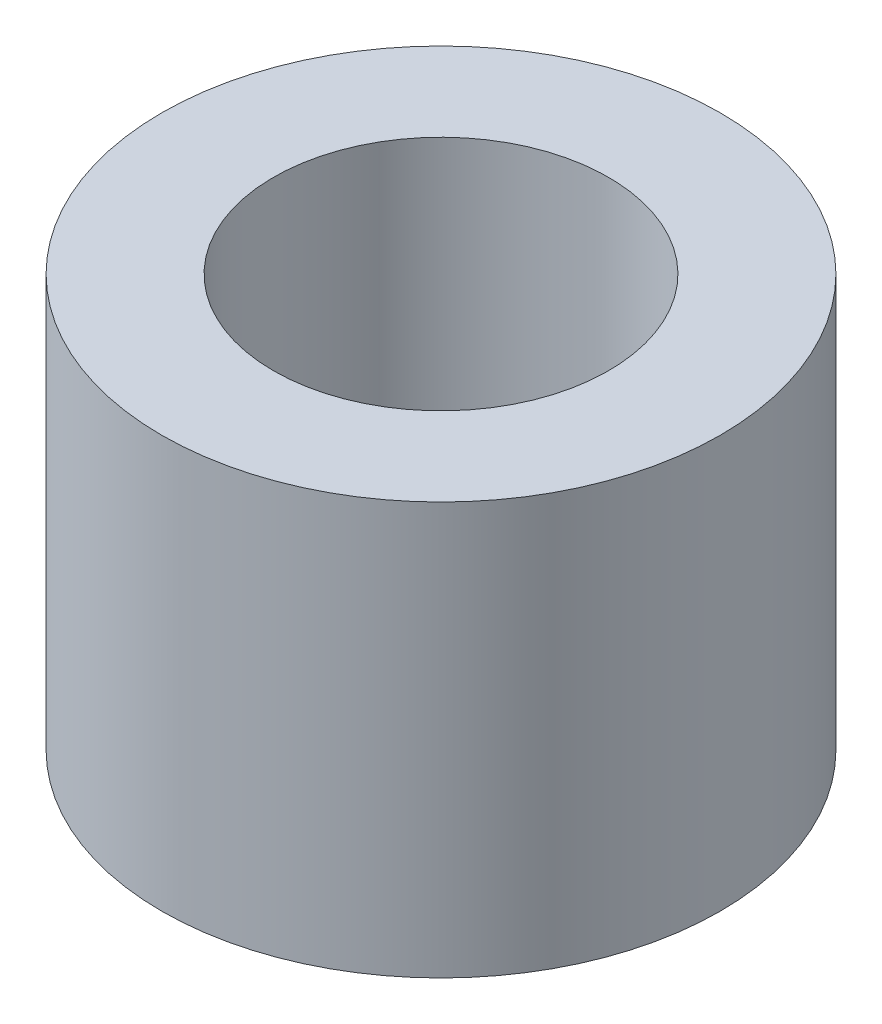
ISO-10303-21;
HEADER;
FILE_DESCRIPTION(('STEP AP214'),'2;1');
FILE_NAME('part.step','',(''),(''),'','','');
FILE_SCHEMA(('AUTOMOTIVE_DESIGN { 1 0 10303 214 1 1 1 1 }'));
ENDSEC;
DATA;
#1=APPLICATION_CONTEXT('core data for automotive mechanical design processes');
#2=APPLICATION_PROTOCOL_DEFINITION('international standard','automotive_design',2000,#1);
#3=PRODUCT_CONTEXT('',#1,'mechanical');
#4=PRODUCT('Part','Part','',(#3));
#5=PRODUCT_RELATED_PRODUCT_CATEGORY('part','',(#4));
#6=PRODUCT_DEFINITION_FORMATION('','',#4);
#7=PRODUCT_DEFINITION_CONTEXT('part definition',#1,'design');
#8=PRODUCT_DEFINITION('design','',#6,#7);
#9=PRODUCT_DEFINITION_SHAPE('','',#8);
#10=(LENGTH_UNIT() NAMED_UNIT(*) SI_UNIT(.MILLI.,.METRE.));
#11=(NAMED_UNIT(*) PLANE_ANGLE_UNIT() SI_UNIT($,.RADIAN.));
#12=(NAMED_UNIT(*) SI_UNIT($,.STERADIAN.) SOLID_ANGLE_UNIT());
#13=UNCERTAINTY_MEASURE_WITH_UNIT(LENGTH_MEASURE(1.E-05),#10,'distance_accuracy_value','');
#14=(GEOMETRIC_REPRESENTATION_CONTEXT(3) GLOBAL_UNCERTAINTY_ASSIGNED_CONTEXT((#13)) GLOBAL_UNIT_ASSIGNED_CONTEXT((#10,
#11,#12)) REPRESENTATION_CONTEXT('',''));
#15=CARTESIAN_POINT('',(0.,0.,0.));
#16=DIRECTION('',(0.,0.,1.));
#17=DIRECTION('',(1.,0.,0.));
#18=AXIS2_PLACEMENT_3D('',#15,#16,#17);
#19=CARTESIAN_POINT('',(0.,7.38,0.));
#20=DIRECTION('',(0.,-1.,0.));
#21=DIRECTION('',(0.,0.,-1.));
#22=AXIS2_PLACEMENT_3D('',#19,#20,#21);
#23=CYLINDRICAL_SURFACE('',#22,5.);
#24=CARTESIAN_POINT('',(0.,7.38,0.));
#25=DIRECTION('',(0.,1.,0.));
#26=DIRECTION('',(0.,0.,1.));
#27=AXIS2_PLACEMENT_3D('',#24,#25,#26);
#28=CIRCLE('',#27,5.);
#29=CARTESIAN_POINT('',(0.,7.38,5.));
#30=VERTEX_POINT('',#29);
#31=EDGE_CURVE('E10',#30,#30,#28,.T.);
#32=ORIENTED_EDGE('',*,*,#31,.F.);
#33=EDGE_LOOP('',(#32));
#34=FACE_BOUND('',#33,.T.);
#35=CARTESIAN_POINT('',(0.,0.,0.));
#36=DIRECTION('',(0.,1.,0.));
#37=DIRECTION('',(0.,0.,1.));
#38=AXIS2_PLACEMENT_3D('',#35,#36,#37);
#39=CIRCLE('',#38,5.);
#40=CARTESIAN_POINT('',(0.,0.,5.));
#41=VERTEX_POINT('',#40);
#42=EDGE_CURVE('E36',#41,#41,#39,.T.);
#43=ORIENTED_EDGE('',*,*,#42,.T.);
#44=EDGE_LOOP('',(#43));
#45=FACE_BOUND('',#44,.T.);
#46=ADVANCED_FACE('F33',(#34,#45),#23,.T.);
#47=CARTESIAN_POINT('',(0.,7.38,0.));
#48=DIRECTION('',(0.,1.,0.));
#49=DIRECTION('',(0.,0.,1.));
#50=AXIS2_PLACEMENT_3D('',#47,#48,#49);
#51=PLANE('',#50);
#52=CARTESIAN_POINT('',(0.,7.38,0.));
#53=DIRECTION('',(0.,1.,0.));
#54=DIRECTION('',(0.,0.,1.));
#55=AXIS2_PLACEMENT_3D('',#52,#53,#54);
#56=CIRCLE('',#55,3.);
#57=CARTESIAN_POINT('',(0.,7.38,3.));
#58=VERTEX_POINT('',#57);
#59=EDGE_CURVE('E45',#58,#58,#56,.T.);
#60=ORIENTED_EDGE('',*,*,#59,.F.);
#61=EDGE_LOOP('',(#60));
#62=FACE_BOUND('',#61,.T.);
#63=ORIENTED_EDGE('',*,*,#31,.T.);
#64=EDGE_LOOP('',(#63));
#65=FACE_BOUND('',#64,.T.);
#66=ADVANCED_FACE('F60',(#62,#65),#51,.T.);
#67=CARTESIAN_POINT('',(0.,0.,0.));
#68=DIRECTION('',(0.,1.,0.));
#69=DIRECTION('',(0.,0.,1.));
#70=AXIS2_PLACEMENT_3D('',#67,#68,#69);
#71=PLANE('',#70);
#72=CARTESIAN_POINT('',(0.,0.,0.));
#73=DIRECTION('',(0.,1.,0.));
#74=DIRECTION('',(0.,0.,1.));
#75=AXIS2_PLACEMENT_3D('',#72,#73,#74);
#76=CIRCLE('',#75,3.);
#77=CARTESIAN_POINT('',(0.,0.,3.));
#78=VERTEX_POINT('',#77);
#79=EDGE_CURVE('E43',#78,#78,#76,.T.);
#80=ORIENTED_EDGE('',*,*,#79,.T.);
#81=EDGE_LOOP('',(#80));
#82=FACE_BOUND('',#81,.T.);
#83=ORIENTED_EDGE('',*,*,#42,.F.);
#84=EDGE_LOOP('',(#83));
#85=FACE_BOUND('',#84,.T.);
#86=ADVANCED_FACE('F51',(#82,#85),#71,.F.);
#87=CARTESIAN_POINT('',(0.,0.,0.));
#88=DIRECTION('',(0.,1.,0.));
#89=DIRECTION('',(0.,0.,1.));
#90=AXIS2_PLACEMENT_3D('',#87,#88,#89);
#91=CYLINDRICAL_SURFACE('',#90,3.);
#92=ORIENTED_EDGE('',*,*,#79,.F.);
#93=EDGE_LOOP('',(#92));
#94=FACE_BOUND('',#93,.T.);
#95=ORIENTED_EDGE('',*,*,#59,.T.);
#96=EDGE_LOOP('',(#95));
#97=FACE_BOUND('',#96,.T.);
#98=ADVANCED_FACE('F54',(#94,#97),#91,.F.);
#99=CLOSED_SHELL('',(#46,#66,#86,#98));
#100=MANIFOLD_SOLID_BREP('B2',#99);
#101=ADVANCED_BREP_SHAPE_REPRESENTATION('',(#18,#100),#14);
#102=SHAPE_DEFINITION_REPRESENTATION(#9,#101);
ENDSEC;
END-ISO-10303-21;
